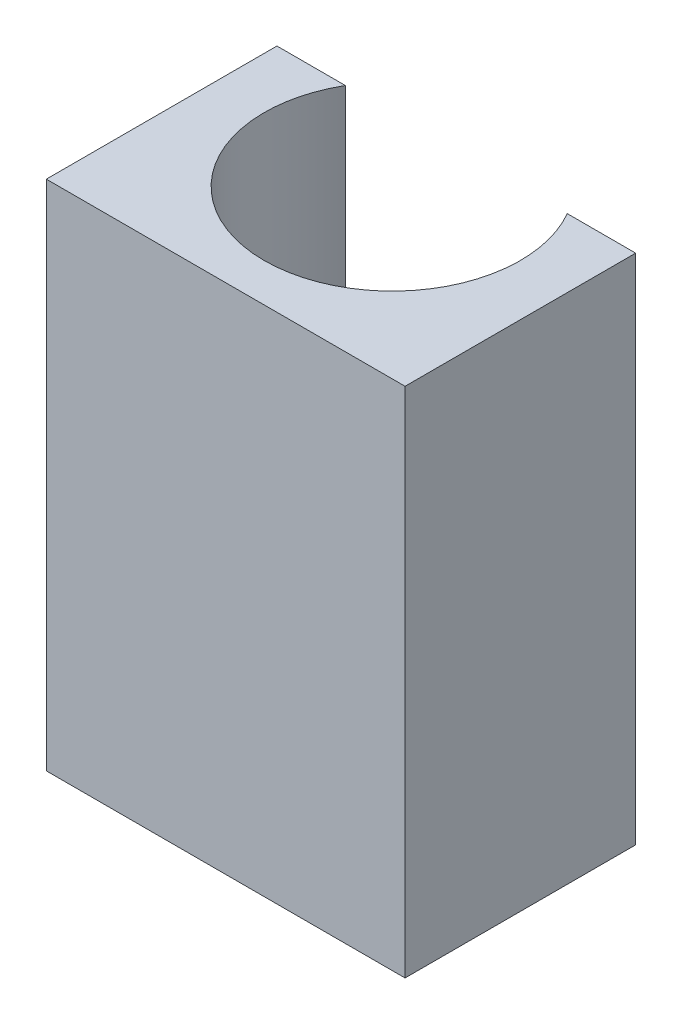
ISO-10303-21;
HEADER;
FILE_DESCRIPTION(('STEP AP214'),'2;1');
FILE_NAME('part.step','',(''),(''),'','','');
FILE_SCHEMA(('AUTOMOTIVE_DESIGN { 1 0 10303 214 1 1 1 1 }'));
ENDSEC;
DATA;
#1=APPLICATION_CONTEXT('core data for automotive mechanical design processes');
#2=APPLICATION_PROTOCOL_DEFINITION('international standard','automotive_design',2000,#1);
#3=PRODUCT_CONTEXT('',#1,'mechanical');
#4=PRODUCT('Part','Part','',(#3));
#5=PRODUCT_RELATED_PRODUCT_CATEGORY('part','',(#4));
#6=PRODUCT_DEFINITION_FORMATION('','',#4);
#7=PRODUCT_DEFINITION_CONTEXT('part definition',#1,'design');
#8=PRODUCT_DEFINITION('design','',#6,#7);
#9=PRODUCT_DEFINITION_SHAPE('','',#8);
#10=(LENGTH_UNIT() NAMED_UNIT(*) SI_UNIT(.MILLI.,.METRE.));
#11=(NAMED_UNIT(*) PLANE_ANGLE_UNIT() SI_UNIT($,.RADIAN.));
#12=(NAMED_UNIT(*) SI_UNIT($,.STERADIAN.) SOLID_ANGLE_UNIT());
#13=UNCERTAINTY_MEASURE_WITH_UNIT(LENGTH_MEASURE(1.E-05),#10,'distance_accuracy_value','');
#14=(GEOMETRIC_REPRESENTATION_CONTEXT(3) GLOBAL_UNCERTAINTY_ASSIGNED_CONTEXT((#13)) GLOBAL_UNIT_ASSIGNED_CONTEXT((#10,
#11,#12)) REPRESENTATION_CONTEXT('',''));
#15=CARTESIAN_POINT('',(0.,0.,0.));
#16=DIRECTION('',(0.,0.,1.));
#17=DIRECTION('',(1.,0.,0.));
#18=AXIS2_PLACEMENT_3D('',#15,#16,#17);
#19=CARTESIAN_POINT('',(-7.,20.,4.5));
#20=DIRECTION('',(1.,0.,0.));
#21=DIRECTION('',(0.,0.,-1.));
#22=AXIS2_PLACEMENT_3D('',#19,#20,#21);
#23=PLANE('',#22);
#24=DIRECTION('',(0.,0.,1.));
#25=VECTOR('',#24,1.);
#26=CARTESIAN_POINT('',(-7.,0.,4.5));
#27=LINE('',#26,#25);
#28=CARTESIAN_POINT('',(-7.,0.,-4.5));
#29=VERTEX_POINT('',#28);
#30=CARTESIAN_POINT('',(-7.,0.,4.5));
#31=VERTEX_POINT('',#30);
#32=EDGE_CURVE('E128',#29,#31,#27,.T.);
#33=ORIENTED_EDGE('',*,*,#32,.T.);
#34=DIRECTION('',(0.,-1.,0.));
#35=VECTOR('',#34,1.);
#36=CARTESIAN_POINT('',(-7.,20.,4.5));
#37=LINE('',#36,#35);
#38=CARTESIAN_POINT('',(-7.,20.,4.5));
#39=VERTEX_POINT('',#38);
#40=EDGE_CURVE('E11',#39,#31,#37,.T.);
#41=ORIENTED_EDGE('',*,*,#40,.F.);
#42=DIRECTION('',(0.,0.,1.));
#43=VECTOR('',#42,1.);
#44=CARTESIAN_POINT('',(-7.,20.,4.5));
#45=LINE('',#44,#43);
#46=CARTESIAN_POINT('',(-7.,20.,-4.5));
#47=VERTEX_POINT('',#46);
#48=EDGE_CURVE('E144',#47,#39,#45,.T.);
#49=ORIENTED_EDGE('',*,*,#48,.F.);
#50=DIRECTION('',(0.,-1.,0.));
#51=VECTOR('',#50,1.);
#52=CARTESIAN_POINT('',(-7.,20.,-4.5));
#53=LINE('',#52,#51);
#54=EDGE_CURVE('E124',#47,#29,#53,.T.);
#55=ORIENTED_EDGE('',*,*,#54,.T.);
#56=EDGE_LOOP('',(#33,#41,#49,#55));
#57=FACE_BOUND('',#56,.T.);
#58=ADVANCED_FACE('F39',(#57),#23,.F.);
#59=CARTESIAN_POINT('',(7.,20.,4.5));
#60=DIRECTION('',(0.,0.,-1.));
#61=DIRECTION('',(-1.,0.,0.));
#62=AXIS2_PLACEMENT_3D('',#59,#60,#61);
#63=PLANE('',#62);
#64=DIRECTION('',(1.,0.,0.));
#65=VECTOR('',#64,1.);
#66=CARTESIAN_POINT('',(7.,0.,4.5));
#67=LINE('',#66,#65);
#68=CARTESIAN_POINT('',(7.,0.,4.5));
#69=VERTEX_POINT('',#68);
#70=EDGE_CURVE('E132',#31,#69,#67,.T.);
#71=ORIENTED_EDGE('',*,*,#70,.T.);
#72=DIRECTION('',(0.,-1.,0.));
#73=VECTOR('',#72,1.);
#74=CARTESIAN_POINT('',(7.,20.,4.5));
#75=LINE('',#74,#73);
#76=CARTESIAN_POINT('',(7.,20.,4.5));
#77=VERTEX_POINT('',#76);
#78=EDGE_CURVE('E48',#77,#69,#75,.T.);
#79=ORIENTED_EDGE('',*,*,#78,.F.);
#80=DIRECTION('',(1.,0.,0.));
#81=VECTOR('',#80,1.);
#82=CARTESIAN_POINT('',(7.,20.,4.5));
#83=LINE('',#82,#81);
#84=EDGE_CURVE('E93',#39,#77,#83,.T.);
#85=ORIENTED_EDGE('',*,*,#84,.F.);
#86=ORIENTED_EDGE('',*,*,#40,.T.);
#87=EDGE_LOOP('',(#71,#79,#85,#86));
#88=FACE_BOUND('',#87,.T.);
#89=ADVANCED_FACE('F172',(#88),#63,.F.);
#90=CARTESIAN_POINT('',(7.,20.,4.5));
#91=DIRECTION('',(-1.,0.,0.));
#92=DIRECTION('',(0.,0.,1.));
#93=AXIS2_PLACEMENT_3D('',#90,#91,#92);
#94=PLANE('',#93);
#95=DIRECTION('',(0.,0.,-1.));
#96=VECTOR('',#95,1.);
#97=CARTESIAN_POINT('',(7.,0.,4.5));
#98=LINE('',#97,#96);
#99=CARTESIAN_POINT('',(7.,0.,-4.5));
#100=VERTEX_POINT('',#99);
#101=EDGE_CURVE('E135',#69,#100,#98,.T.);
#102=ORIENTED_EDGE('',*,*,#101,.T.);
#103=DIRECTION('',(0.,-1.,0.));
#104=VECTOR('',#103,1.);
#105=CARTESIAN_POINT('',(7.,20.,-4.5));
#106=LINE('',#105,#104);
#107=CARTESIAN_POINT('',(7.,20.,-4.5));
#108=VERTEX_POINT('',#107);
#109=EDGE_CURVE('E117',#108,#100,#106,.T.);
#110=ORIENTED_EDGE('',*,*,#109,.F.);
#111=DIRECTION('',(0.,0.,-1.));
#112=VECTOR('',#111,1.);
#113=CARTESIAN_POINT('',(7.,20.,4.5));
#114=LINE('',#113,#112);
#115=EDGE_CURVE('E106',#77,#108,#114,.T.);
#116=ORIENTED_EDGE('',*,*,#115,.F.);
#117=ORIENTED_EDGE('',*,*,#78,.T.);
#118=EDGE_LOOP('',(#102,#110,#116,#117));
#119=FACE_BOUND('',#118,.T.);
#120=ADVANCED_FACE('F154',(#119),#94,.F.);
#121=CARTESIAN_POINT('',(7.,20.,-4.5));
#122=DIRECTION('',(0.,0.,1.));
#123=DIRECTION('',(1.,0.,0.));
#124=AXIS2_PLACEMENT_3D('',#121,#122,#123);
#125=PLANE('',#124);
#126=DIRECTION('',(-1.,0.,0.));
#127=VECTOR('',#126,1.);
#128=CARTESIAN_POINT('',(7.,0.,-4.5));
#129=LINE('',#128,#127);
#130=CARTESIAN_POINT('',(4.3301270189222,0.,-4.5));
#131=VERTEX_POINT('',#130);
#132=EDGE_CURVE('E115',#100,#131,#129,.T.);
#133=ORIENTED_EDGE('',*,*,#132,.T.);
#134=DIRECTION('',(0.,-1.,0.));
#135=VECTOR('',#134,1.);
#136=CARTESIAN_POINT('',(4.3301270189222,20.,-4.5));
#137=LINE('',#136,#135);
#138=CARTESIAN_POINT('',(4.3301270189222,20.,-4.5));
#139=VERTEX_POINT('',#138);
#140=EDGE_CURVE('E112',#139,#131,#137,.T.);
#141=ORIENTED_EDGE('',*,*,#140,.F.);
#142=DIRECTION('',(-1.,0.,0.));
#143=VECTOR('',#142,1.);
#144=CARTESIAN_POINT('',(7.,20.,-4.5));
#145=LINE('',#144,#143);
#146=EDGE_CURVE('E100',#108,#139,#145,.T.);
#147=ORIENTED_EDGE('',*,*,#146,.F.);
#148=ORIENTED_EDGE('',*,*,#109,.T.);
#149=EDGE_LOOP('',(#133,#141,#147,#148));
#150=FACE_BOUND('',#149,.T.);
#151=ADVANCED_FACE('F113',(#150),#125,.F.);
#152=CARTESIAN_POINT('',(0.,20.,-2.));
#153=DIRECTION('',(0.,-1.,0.));
#154=DIRECTION('',(0.,0.,-1.));
#155=AXIS2_PLACEMENT_3D('',#152,#153,#154);
#156=CYLINDRICAL_SURFACE('',#155,5.);
#157=CARTESIAN_POINT('',(0.,0.,-2.));
#158=DIRECTION('',(0.,-1.,0.));
#159=DIRECTION('',(0.,0.,1.));
#160=AXIS2_PLACEMENT_3D('',#157,#158,#159);
#161=CIRCLE('',#160,5.);
#162=CARTESIAN_POINT('',(-4.3301270189222,0.,-4.5));
#163=VERTEX_POINT('',#162);
#164=EDGE_CURVE('E79',#131,#163,#161,.T.);
#165=ORIENTED_EDGE('',*,*,#164,.T.);
#166=DIRECTION('',(0.,-1.,0.));
#167=VECTOR('',#166,1.);
#168=CARTESIAN_POINT('',(-4.3301270189222,20.,-4.5));
#169=LINE('',#168,#167);
#170=CARTESIAN_POINT('',(-4.3301270189222,20.,-4.5));
#171=VERTEX_POINT('',#170);
#172=EDGE_CURVE('E118',#171,#163,#169,.T.);
#173=ORIENTED_EDGE('',*,*,#172,.F.);
#174=CARTESIAN_POINT('',(0.,20.,-2.));
#175=DIRECTION('',(0.,-1.,0.));
#176=DIRECTION('',(0.,0.,1.));
#177=AXIS2_PLACEMENT_3D('',#174,#175,#176);
#178=CIRCLE('',#177,5.);
#179=EDGE_CURVE('E104',#139,#171,#178,.T.);
#180=ORIENTED_EDGE('',*,*,#179,.F.);
#181=ORIENTED_EDGE('',*,*,#140,.T.);
#182=EDGE_LOOP('',(#165,#173,#180,#181));
#183=FACE_BOUND('',#182,.T.);
#184=ADVANCED_FACE('F120',(#183),#156,.F.);
#185=CARTESIAN_POINT('',(-4.3301270189222,20.,-4.5));
#186=DIRECTION('',(0.,0.,1.));
#187=DIRECTION('',(1.,0.,0.));
#188=AXIS2_PLACEMENT_3D('',#185,#186,#187);
#189=PLANE('',#188);
#190=DIRECTION('',(-1.,0.,0.));
#191=VECTOR('',#190,1.);
#192=CARTESIAN_POINT('',(-4.3301270189222,0.,-4.5));
#193=LINE('',#192,#191);
#194=EDGE_CURVE('E85',#163,#29,#193,.T.);
#195=ORIENTED_EDGE('',*,*,#194,.T.);
#196=ORIENTED_EDGE('',*,*,#54,.F.);
#197=DIRECTION('',(-1.,0.,0.));
#198=VECTOR('',#197,1.);
#199=CARTESIAN_POINT('',(-4.3301270189222,20.,-4.5));
#200=LINE('',#199,#198);
#201=EDGE_CURVE('E56',#171,#47,#200,.T.);
#202=ORIENTED_EDGE('',*,*,#201,.F.);
#203=ORIENTED_EDGE('',*,*,#172,.T.);
#204=EDGE_LOOP('',(#195,#196,#202,#203));
#205=FACE_BOUND('',#204,.T.);
#206=ADVANCED_FACE('F161',(#205),#189,.F.);
#207=CARTESIAN_POINT('',(0.,20.,-2.));
#208=DIRECTION('',(0.,1.,0.));
#209=DIRECTION('',(0.,0.,1.));
#210=AXIS2_PLACEMENT_3D('',#207,#208,#209);
#211=PLANE('',#210);
#212=ORIENTED_EDGE('',*,*,#48,.T.);
#213=ORIENTED_EDGE('',*,*,#84,.T.);
#214=ORIENTED_EDGE('',*,*,#115,.T.);
#215=ORIENTED_EDGE('',*,*,#146,.T.);
#216=ORIENTED_EDGE('',*,*,#179,.T.);
#217=ORIENTED_EDGE('',*,*,#201,.T.);
#218=EDGE_LOOP('',(#212,#213,#214,#215,#216,#217));
#219=FACE_BOUND('',#218,.T.);
#220=ADVANCED_FACE('F102',(#219),#211,.T.);
#221=CARTESIAN_POINT('',(0.,0.,-2.));
#222=DIRECTION('',(0.,1.,0.));
#223=DIRECTION('',(0.,0.,1.));
#224=AXIS2_PLACEMENT_3D('',#221,#222,#223);
#225=PLANE('',#224);
#226=ORIENTED_EDGE('',*,*,#32,.F.);
#227=ORIENTED_EDGE('',*,*,#194,.F.);
#228=ORIENTED_EDGE('',*,*,#164,.F.);
#229=ORIENTED_EDGE('',*,*,#132,.F.);
#230=ORIENTED_EDGE('',*,*,#101,.F.);
#231=ORIENTED_EDGE('',*,*,#70,.F.);
#232=EDGE_LOOP('',(#226,#227,#228,#229,#230,#231));
#233=FACE_BOUND('',#232,.T.);
#234=ADVANCED_FACE('F157',(#233),#225,.F.);
#235=CLOSED_SHELL('',(#58,#89,#120,#151,#184,#206,#220,#234));
#236=MANIFOLD_SOLID_BREP('B2',#235);
#237=ADVANCED_BREP_SHAPE_REPRESENTATION('',(#18,#236),#14);
#238=SHAPE_DEFINITION_REPRESENTATION(#9,#237);
ENDSEC;
END-ISO-10303-21;
